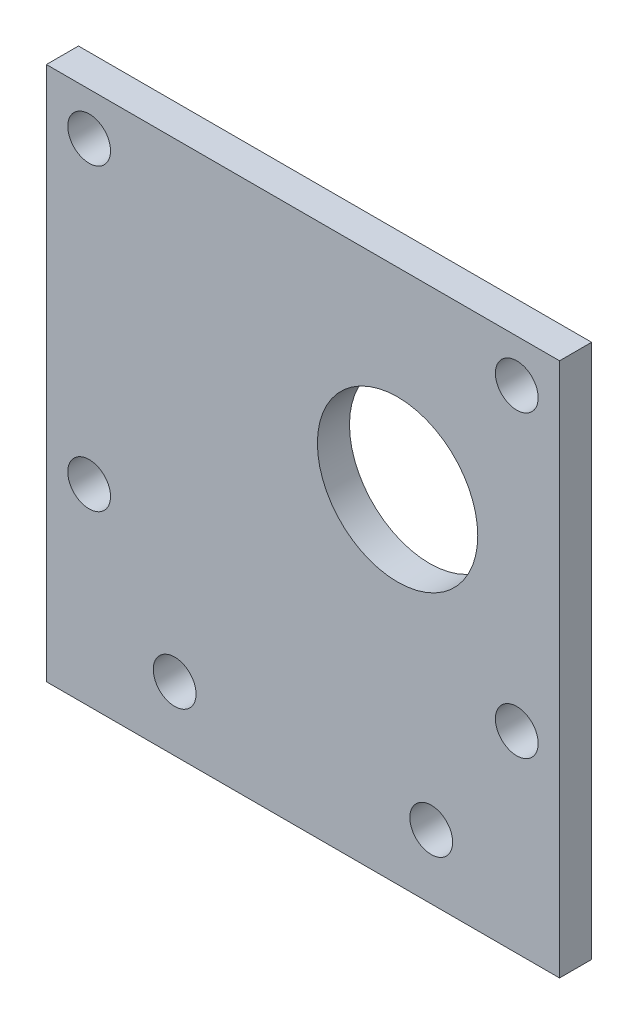
ISO-10303-21;
HEADER;
FILE_DESCRIPTION(('STEP AP214'),'2;1');
FILE_NAME('part.step','',(''),(''),'','','');
FILE_SCHEMA(('AUTOMOTIVE_DESIGN { 1 0 10303 214 1 1 1 1 }'));
ENDSEC;
DATA;
#1=APPLICATION_CONTEXT('core data for automotive mechanical design processes');
#2=APPLICATION_PROTOCOL_DEFINITION('international standard','automotive_design',2000,#1);
#3=PRODUCT_CONTEXT('',#1,'mechanical');
#4=PRODUCT('Part','Part','',(#3));
#5=PRODUCT_RELATED_PRODUCT_CATEGORY('part','',(#4));
#6=PRODUCT_DEFINITION_FORMATION('','',#4);
#7=PRODUCT_DEFINITION_CONTEXT('part definition',#1,'design');
#8=PRODUCT_DEFINITION('design','',#6,#7);
#9=PRODUCT_DEFINITION_SHAPE('','',#8);
#10=(LENGTH_UNIT() NAMED_UNIT(*) SI_UNIT(.MILLI.,.METRE.));
#11=(NAMED_UNIT(*) PLANE_ANGLE_UNIT() SI_UNIT($,.RADIAN.));
#12=(NAMED_UNIT(*) SI_UNIT($,.STERADIAN.) SOLID_ANGLE_UNIT());
#13=UNCERTAINTY_MEASURE_WITH_UNIT(LENGTH_MEASURE(1.E-05),#10,'distance_accuracy_value','');
#14=(GEOMETRIC_REPRESENTATION_CONTEXT(3) GLOBAL_UNCERTAINTY_ASSIGNED_CONTEXT((#13)) GLOBAL_UNIT_ASSIGNED_CONTEXT((#10,
#11,#12)) REPRESENTATION_CONTEXT('',''));
#15=CARTESIAN_POINT('',(0.,0.,0.));
#16=DIRECTION('',(0.,0.,1.));
#17=DIRECTION('',(1.,0.,0.));
#18=AXIS2_PLACEMENT_3D('',#15,#16,#17);
#19=CARTESIAN_POINT('',(0.,0.,3.));
#20=DIRECTION('',(0.,0.,-1.));
#21=DIRECTION('',(-1.,0.,0.));
#22=AXIS2_PLACEMENT_3D('',#19,#20,#21);
#23=PLANE('',#22);
#24=DIRECTION('',(0.,-1.,0.));
#25=VECTOR('',#24,1.);
#26=CARTESIAN_POINT('',(0.,0.,3.));
#27=LINE('',#26,#25);
#28=CARTESIAN_POINT('',(0.,50.,3.));
#29=VERTEX_POINT('',#28);
#30=CARTESIAN_POINT('',(0.,0.,3.));
#31=VERTEX_POINT('',#30);
#32=EDGE_CURVE('E85',#29,#31,#27,.T.);
#33=ORIENTED_EDGE('',*,*,#32,.T.);
#34=DIRECTION('',(1.,0.,0.));
#35=VECTOR('',#34,1.);
#36=CARTESIAN_POINT('',(0.,0.,3.));
#37=LINE('',#36,#35);
#38=CARTESIAN_POINT('',(48.,0.,3.));
#39=VERTEX_POINT('',#38);
#40=EDGE_CURVE('E80',#31,#39,#37,.T.);
#41=ORIENTED_EDGE('',*,*,#40,.T.);
#42=DIRECTION('',(0.,1.,0.));
#43=VECTOR('',#42,1.);
#44=CARTESIAN_POINT('',(48.,0.,3.));
#45=LINE('',#44,#43);
#46=CARTESIAN_POINT('',(48.,50.,3.));
#47=VERTEX_POINT('',#46);
#48=EDGE_CURVE('E83',#39,#47,#45,.T.);
#49=ORIENTED_EDGE('',*,*,#48,.T.);
#50=DIRECTION('',(-1.,0.,0.));
#51=VECTOR('',#50,1.);
#52=CARTESIAN_POINT('',(0.,50.,3.));
#53=LINE('',#52,#51);
#54=EDGE_CURVE('E50',#47,#29,#53,.T.);
#55=ORIENTED_EDGE('',*,*,#54,.T.);
#56=EDGE_LOOP('',(#33,#41,#49,#55));
#57=FACE_BOUND('',#56,.T.);
#58=CARTESIAN_POINT('',(4.,46.,3.));
#59=DIRECTION('',(0.,0.,1.));
#60=DIRECTION('',(1.,0.,0.));
#61=AXIS2_PLACEMENT_3D('',#58,#59,#60);
#62=CIRCLE('',#61,2.);
#63=CARTESIAN_POINT('',(6.,46.,3.));
#64=VERTEX_POINT('',#63);
#65=EDGE_CURVE('E100',#64,#64,#62,.T.);
#66=ORIENTED_EDGE('',*,*,#65,.F.);
#67=EDGE_LOOP('',(#66));
#68=FACE_BOUND('',#67,.T.);
#69=CARTESIAN_POINT('',(44.,46.,3.));
#70=DIRECTION('',(0.,0.,1.));
#71=DIRECTION('',(1.,0.,0.));
#72=AXIS2_PLACEMENT_3D('',#69,#70,#71);
#73=CIRCLE('',#72,2.);
#74=CARTESIAN_POINT('',(46.,46.,3.));
#75=VERTEX_POINT('',#74);
#76=EDGE_CURVE('E115',#75,#75,#73,.T.);
#77=ORIENTED_EDGE('',*,*,#76,.F.);
#78=EDGE_LOOP('',(#77));
#79=FACE_BOUND('',#78,.T.);
#80=CARTESIAN_POINT('',(44.,18.,3.));
#81=DIRECTION('',(0.,0.,1.));
#82=DIRECTION('',(1.,0.,0.));
#83=AXIS2_PLACEMENT_3D('',#80,#81,#82);
#84=CIRCLE('',#83,2.);
#85=CARTESIAN_POINT('',(46.,18.,3.));
#86=VERTEX_POINT('',#85);
#87=EDGE_CURVE('E121',#86,#86,#84,.T.);
#88=ORIENTED_EDGE('',*,*,#87,.F.);
#89=EDGE_LOOP('',(#88));
#90=FACE_BOUND('',#89,.T.);
#91=CARTESIAN_POINT('',(4.,18.,3.));
#92=DIRECTION('',(0.,0.,1.));
#93=DIRECTION('',(1.,0.,0.));
#94=AXIS2_PLACEMENT_3D('',#91,#92,#93);
#95=CIRCLE('',#94,2.);
#96=CARTESIAN_POINT('',(6.,18.,3.));
#97=VERTEX_POINT('',#96);
#98=EDGE_CURVE('E127',#97,#97,#95,.T.);
#99=ORIENTED_EDGE('',*,*,#98,.F.);
#100=EDGE_LOOP('',(#99));
#101=FACE_BOUND('',#100,.T.);
#102=CARTESIAN_POINT('',(12.,6.,3.));
#103=DIRECTION('',(0.,0.,1.));
#104=DIRECTION('',(1.,0.,0.));
#105=AXIS2_PLACEMENT_3D('',#102,#103,#104);
#106=CIRCLE('',#105,2.);
#107=CARTESIAN_POINT('',(14.,6.,3.));
#108=VERTEX_POINT('',#107);
#109=EDGE_CURVE('E133',#108,#108,#106,.T.);
#110=ORIENTED_EDGE('',*,*,#109,.F.);
#111=EDGE_LOOP('',(#110));
#112=FACE_BOUND('',#111,.T.);
#113=CARTESIAN_POINT('',(32.85,32.,3.));
#114=DIRECTION('',(0.,0.,1.));
#115=DIRECTION('',(1.,0.,0.));
#116=AXIS2_PLACEMENT_3D('',#113,#114,#115);
#117=CIRCLE('',#116,7.5);
#118=CARTESIAN_POINT('',(40.35,32.,3.));
#119=VERTEX_POINT('',#118);
#120=EDGE_CURVE('E139',#119,#119,#117,.T.);
#121=ORIENTED_EDGE('',*,*,#120,.F.);
#122=EDGE_LOOP('',(#121));
#123=FACE_BOUND('',#122,.T.);
#124=CARTESIAN_POINT('',(36.,6.,3.));
#125=DIRECTION('',(0.,0.,1.));
#126=DIRECTION('',(1.,0.,0.));
#127=AXIS2_PLACEMENT_3D('',#124,#125,#126);
#128=CIRCLE('',#127,2.);
#129=CARTESIAN_POINT('',(38.,6.,3.));
#130=VERTEX_POINT('',#129);
#131=EDGE_CURVE('E145',#130,#130,#128,.T.);
#132=ORIENTED_EDGE('',*,*,#131,.F.);
#133=EDGE_LOOP('',(#132));
#134=FACE_BOUND('',#133,.T.);
#135=ADVANCED_FACE('F33',(#57,#68,#79,#90,#101,#112,#123,#134),#23,.F.);
#136=CARTESIAN_POINT('',(0.,0.,0.));
#137=DIRECTION('',(0.,0.,-1.));
#138=DIRECTION('',(-1.,0.,0.));
#139=AXIS2_PLACEMENT_3D('',#136,#137,#138);
#140=PLANE('',#139);
#141=CARTESIAN_POINT('',(32.85,32.,0.));
#142=DIRECTION('',(0.,0.,1.));
#143=DIRECTION('',(1.,0.,0.));
#144=AXIS2_PLACEMENT_3D('',#141,#142,#143);
#145=CIRCLE('',#144,7.5);
#146=CARTESIAN_POINT('',(40.35,32.,0.));
#147=VERTEX_POINT('',#146);
#148=EDGE_CURVE('E142',#147,#147,#145,.T.);
#149=ORIENTED_EDGE('',*,*,#148,.T.);
#150=EDGE_LOOP('',(#149));
#151=FACE_BOUND('',#150,.T.);
#152=CARTESIAN_POINT('',(4.,18.,0.));
#153=DIRECTION('',(0.,0.,1.));
#154=DIRECTION('',(1.,0.,0.));
#155=AXIS2_PLACEMENT_3D('',#152,#153,#154);
#156=CIRCLE('',#155,2.);
#157=CARTESIAN_POINT('',(6.,18.,0.));
#158=VERTEX_POINT('',#157);
#159=EDGE_CURVE('E130',#158,#158,#156,.T.);
#160=ORIENTED_EDGE('',*,*,#159,.T.);
#161=EDGE_LOOP('',(#160));
#162=FACE_BOUND('',#161,.T.);
#163=CARTESIAN_POINT('',(44.,46.,0.));
#164=DIRECTION('',(0.,0.,1.));
#165=DIRECTION('',(1.,0.,0.));
#166=AXIS2_PLACEMENT_3D('',#163,#164,#165);
#167=CIRCLE('',#166,2.);
#168=CARTESIAN_POINT('',(46.,46.,0.));
#169=VERTEX_POINT('',#168);
#170=EDGE_CURVE('E118',#169,#169,#167,.T.);
#171=ORIENTED_EDGE('',*,*,#170,.T.);
#172=EDGE_LOOP('',(#171));
#173=FACE_BOUND('',#172,.T.);
#174=DIRECTION('',(0.,-1.,0.));
#175=VECTOR('',#174,1.);
#176=CARTESIAN_POINT('',(0.,0.,0.));
#177=LINE('',#176,#175);
#178=CARTESIAN_POINT('',(0.,50.,0.));
#179=VERTEX_POINT('',#178);
#180=CARTESIAN_POINT('',(0.,0.,0.));
#181=VERTEX_POINT('',#180);
#182=EDGE_CURVE('E97',#179,#181,#177,.T.);
#183=ORIENTED_EDGE('',*,*,#182,.F.);
#184=DIRECTION('',(-1.,0.,0.));
#185=VECTOR('',#184,1.);
#186=CARTESIAN_POINT('',(0.,50.,0.));
#187=LINE('',#186,#185);
#188=CARTESIAN_POINT('',(48.,50.,0.));
#189=VERTEX_POINT('',#188);
#190=EDGE_CURVE('E73',#189,#179,#187,.T.);
#191=ORIENTED_EDGE('',*,*,#190,.F.);
#192=DIRECTION('',(0.,1.,0.));
#193=VECTOR('',#192,1.);
#194=CARTESIAN_POINT('',(48.,0.,0.));
#195=LINE('',#194,#193);
#196=CARTESIAN_POINT('',(48.,0.,0.));
#197=VERTEX_POINT('',#196);
#198=EDGE_CURVE('E67',#197,#189,#195,.T.);
#199=ORIENTED_EDGE('',*,*,#198,.F.);
#200=DIRECTION('',(1.,0.,0.));
#201=VECTOR('',#200,1.);
#202=CARTESIAN_POINT('',(0.,0.,0.));
#203=LINE('',#202,#201);
#204=EDGE_CURVE('E89',#181,#197,#203,.T.);
#205=ORIENTED_EDGE('',*,*,#204,.F.);
#206=EDGE_LOOP('',(#183,#191,#199,#205));
#207=FACE_BOUND('',#206,.T.);
#208=CARTESIAN_POINT('',(4.,46.,0.));
#209=DIRECTION('',(0.,0.,1.));
#210=DIRECTION('',(1.,0.,0.));
#211=AXIS2_PLACEMENT_3D('',#208,#209,#210);
#212=CIRCLE('',#211,2.);
#213=CARTESIAN_POINT('',(6.,46.,0.));
#214=VERTEX_POINT('',#213);
#215=EDGE_CURVE('E112',#214,#214,#212,.T.);
#216=ORIENTED_EDGE('',*,*,#215,.T.);
#217=EDGE_LOOP('',(#216));
#218=FACE_BOUND('',#217,.T.);
#219=CARTESIAN_POINT('',(44.,18.,0.));
#220=DIRECTION('',(0.,0.,1.));
#221=DIRECTION('',(1.,0.,0.));
#222=AXIS2_PLACEMENT_3D('',#219,#220,#221);
#223=CIRCLE('',#222,2.);
#224=CARTESIAN_POINT('',(46.,18.,0.));
#225=VERTEX_POINT('',#224);
#226=EDGE_CURVE('E124',#225,#225,#223,.T.);
#227=ORIENTED_EDGE('',*,*,#226,.T.);
#228=EDGE_LOOP('',(#227));
#229=FACE_BOUND('',#228,.T.);
#230=CARTESIAN_POINT('',(12.,6.,0.));
#231=DIRECTION('',(0.,0.,1.));
#232=DIRECTION('',(1.,0.,0.));
#233=AXIS2_PLACEMENT_3D('',#230,#231,#232);
#234=CIRCLE('',#233,2.);
#235=CARTESIAN_POINT('',(14.,6.,0.));
#236=VERTEX_POINT('',#235);
#237=EDGE_CURVE('E136',#236,#236,#234,.T.);
#238=ORIENTED_EDGE('',*,*,#237,.T.);
#239=EDGE_LOOP('',(#238));
#240=FACE_BOUND('',#239,.T.);
#241=CARTESIAN_POINT('',(36.,6.,0.));
#242=DIRECTION('',(0.,0.,1.));
#243=DIRECTION('',(1.,0.,0.));
#244=AXIS2_PLACEMENT_3D('',#241,#242,#243);
#245=CIRCLE('',#244,2.);
#246=CARTESIAN_POINT('',(38.,6.,0.));
#247=VERTEX_POINT('',#246);
#248=EDGE_CURVE('E148',#247,#247,#245,.T.);
#249=ORIENTED_EDGE('',*,*,#248,.T.);
#250=EDGE_LOOP('',(#249));
#251=FACE_BOUND('',#250,.T.);
#252=ADVANCED_FACE('F108',(#151,#162,#173,#207,#218,#229,#240,#251),#140,.T.);
#253=CARTESIAN_POINT('',(0.,0.,3.));
#254=DIRECTION('',(1.,0.,0.));
#255=DIRECTION('',(0.,0.,-1.));
#256=AXIS2_PLACEMENT_3D('',#253,#254,#255);
#257=PLANE('',#256);
#258=ORIENTED_EDGE('',*,*,#182,.T.);
#259=DIRECTION('',(0.,0.,-1.));
#260=VECTOR('',#259,1.);
#261=CARTESIAN_POINT('',(0.,0.,3.));
#262=LINE('',#261,#260);
#263=EDGE_CURVE('E11',#31,#181,#262,.T.);
#264=ORIENTED_EDGE('',*,*,#263,.F.);
#265=ORIENTED_EDGE('',*,*,#32,.F.);
#266=DIRECTION('',(0.,0.,-1.));
#267=VECTOR('',#266,1.);
#268=CARTESIAN_POINT('',(0.,50.,3.));
#269=LINE('',#268,#267);
#270=EDGE_CURVE('E93',#29,#179,#269,.T.);
#271=ORIENTED_EDGE('',*,*,#270,.T.);
#272=EDGE_LOOP('',(#258,#264,#265,#271));
#273=FACE_BOUND('',#272,.T.);
#274=ADVANCED_FACE('F35',(#273),#257,.F.);
#275=CARTESIAN_POINT('',(0.,0.,3.));
#276=DIRECTION('',(0.,1.,0.));
#277=DIRECTION('',(0.,0.,1.));
#278=AXIS2_PLACEMENT_3D('',#275,#276,#277);
#279=PLANE('',#278);
#280=ORIENTED_EDGE('',*,*,#204,.T.);
#281=DIRECTION('',(0.,0.,-1.));
#282=VECTOR('',#281,1.);
#283=CARTESIAN_POINT('',(48.,0.,3.));
#284=LINE('',#283,#282);
#285=EDGE_CURVE('E42',#39,#197,#284,.T.);
#286=ORIENTED_EDGE('',*,*,#285,.F.);
#287=ORIENTED_EDGE('',*,*,#40,.F.);
#288=ORIENTED_EDGE('',*,*,#263,.T.);
#289=EDGE_LOOP('',(#280,#286,#287,#288));
#290=FACE_BOUND('',#289,.T.);
#291=ADVANCED_FACE('F88',(#290),#279,.F.);
#292=CARTESIAN_POINT('',(48.,0.,3.));
#293=DIRECTION('',(-1.,0.,0.));
#294=DIRECTION('',(0.,0.,1.));
#295=AXIS2_PLACEMENT_3D('',#292,#293,#294);
#296=PLANE('',#295);
#297=ORIENTED_EDGE('',*,*,#198,.T.);
#298=DIRECTION('',(0.,0.,-1.));
#299=VECTOR('',#298,1.);
#300=CARTESIAN_POINT('',(48.,50.,3.));
#301=LINE('',#300,#299);
#302=EDGE_CURVE('E90',#47,#189,#301,.T.);
#303=ORIENTED_EDGE('',*,*,#302,.F.);
#304=ORIENTED_EDGE('',*,*,#48,.F.);
#305=ORIENTED_EDGE('',*,*,#285,.T.);
#306=EDGE_LOOP('',(#297,#303,#304,#305));
#307=FACE_BOUND('',#306,.T.);
#308=ADVANCED_FACE('F91',(#307),#296,.F.);
#309=CARTESIAN_POINT('',(0.,50.,3.));
#310=DIRECTION('',(0.,-1.,0.));
#311=DIRECTION('',(0.,0.,-1.));
#312=AXIS2_PLACEMENT_3D('',#309,#310,#311);
#313=PLANE('',#312);
#314=ORIENTED_EDGE('',*,*,#190,.T.);
#315=ORIENTED_EDGE('',*,*,#270,.F.);
#316=ORIENTED_EDGE('',*,*,#54,.F.);
#317=ORIENTED_EDGE('',*,*,#302,.T.);
#318=EDGE_LOOP('',(#314,#315,#316,#317));
#319=FACE_BOUND('',#318,.T.);
#320=ADVANCED_FACE('F105',(#319),#313,.F.);
#321=CARTESIAN_POINT('',(4.,46.,3.));
#322=DIRECTION('',(0.,0.,-1.));
#323=DIRECTION('',(-1.,0.,0.));
#324=AXIS2_PLACEMENT_3D('',#321,#322,#323);
#325=CYLINDRICAL_SURFACE('',#324,2.);
#326=ORIENTED_EDGE('',*,*,#65,.T.);
#327=EDGE_LOOP('',(#326));
#328=FACE_BOUND('',#327,.T.);
#329=ORIENTED_EDGE('',*,*,#215,.F.);
#330=EDGE_LOOP('',(#329));
#331=FACE_BOUND('',#330,.T.);
#332=ADVANCED_FACE('F165',(#328,#331),#325,.F.);
#333=CARTESIAN_POINT('',(44.,46.,3.));
#334=DIRECTION('',(0.,0.,-1.));
#335=DIRECTION('',(-1.,0.,0.));
#336=AXIS2_PLACEMENT_3D('',#333,#334,#335);
#337=CYLINDRICAL_SURFACE('',#336,2.);
#338=ORIENTED_EDGE('',*,*,#76,.T.);
#339=EDGE_LOOP('',(#338));
#340=FACE_BOUND('',#339,.T.);
#341=ORIENTED_EDGE('',*,*,#170,.F.);
#342=EDGE_LOOP('',(#341));
#343=FACE_BOUND('',#342,.T.);
#344=ADVANCED_FACE('F211',(#340,#343),#337,.F.);
#345=CARTESIAN_POINT('',(44.,18.,3.));
#346=DIRECTION('',(0.,0.,-1.));
#347=DIRECTION('',(-1.,0.,0.));
#348=AXIS2_PLACEMENT_3D('',#345,#346,#347);
#349=CYLINDRICAL_SURFACE('',#348,2.);
#350=ORIENTED_EDGE('',*,*,#87,.T.);
#351=EDGE_LOOP('',(#350));
#352=FACE_BOUND('',#351,.T.);
#353=ORIENTED_EDGE('',*,*,#226,.F.);
#354=EDGE_LOOP('',(#353));
#355=FACE_BOUND('',#354,.T.);
#356=ADVANCED_FACE('F219',(#352,#355),#349,.F.);
#357=CARTESIAN_POINT('',(4.,18.,3.));
#358=DIRECTION('',(0.,0.,-1.));
#359=DIRECTION('',(-1.,0.,0.));
#360=AXIS2_PLACEMENT_3D('',#357,#358,#359);
#361=CYLINDRICAL_SURFACE('',#360,2.);
#362=ORIENTED_EDGE('',*,*,#98,.T.);
#363=EDGE_LOOP('',(#362));
#364=FACE_BOUND('',#363,.T.);
#365=ORIENTED_EDGE('',*,*,#159,.F.);
#366=EDGE_LOOP('',(#365));
#367=FACE_BOUND('',#366,.T.);
#368=ADVANCED_FACE('F227',(#364,#367),#361,.F.);
#369=CARTESIAN_POINT('',(12.,6.,3.));
#370=DIRECTION('',(0.,0.,-1.));
#371=DIRECTION('',(-1.,0.,0.));
#372=AXIS2_PLACEMENT_3D('',#369,#370,#371);
#373=CYLINDRICAL_SURFACE('',#372,2.);
#374=ORIENTED_EDGE('',*,*,#109,.T.);
#375=EDGE_LOOP('',(#374));
#376=FACE_BOUND('',#375,.T.);
#377=ORIENTED_EDGE('',*,*,#237,.F.);
#378=EDGE_LOOP('',(#377));
#379=FACE_BOUND('',#378,.T.);
#380=ADVANCED_FACE('F236',(#376,#379),#373,.F.);
#381=CARTESIAN_POINT('',(32.85,32.,3.));
#382=DIRECTION('',(0.,0.,-1.));
#383=DIRECTION('',(-1.,0.,0.));
#384=AXIS2_PLACEMENT_3D('',#381,#382,#383);
#385=CYLINDRICAL_SURFACE('',#384,7.5);
#386=ORIENTED_EDGE('',*,*,#120,.T.);
#387=EDGE_LOOP('',(#386));
#388=FACE_BOUND('',#387,.T.);
#389=ORIENTED_EDGE('',*,*,#148,.F.);
#390=EDGE_LOOP('',(#389));
#391=FACE_BOUND('',#390,.T.);
#392=ADVANCED_FACE('F245',(#388,#391),#385,.F.);
#393=CARTESIAN_POINT('',(36.,6.,3.));
#394=DIRECTION('',(0.,0.,-1.));
#395=DIRECTION('',(-1.,0.,0.));
#396=AXIS2_PLACEMENT_3D('',#393,#394,#395);
#397=CYLINDRICAL_SURFACE('',#396,2.);
#398=ORIENTED_EDGE('',*,*,#131,.T.);
#399=EDGE_LOOP('',(#398));
#400=FACE_BOUND('',#399,.T.);
#401=ORIENTED_EDGE('',*,*,#248,.F.);
#402=EDGE_LOOP('',(#401));
#403=FACE_BOUND('',#402,.T.);
#404=ADVANCED_FACE('F154',(#400,#403),#397,.F.);
#405=CLOSED_SHELL('',(#135,#252,#274,#291,#308,#320,#332,#344,#356,#368,#380,#392,#404));
#406=MANIFOLD_SOLID_BREP('B2',#405);
#407=ADVANCED_BREP_SHAPE_REPRESENTATION('',(#18,#406),#14);
#408=SHAPE_DEFINITION_REPRESENTATION(#9,#407);
ENDSEC;
END-ISO-10303-21;
